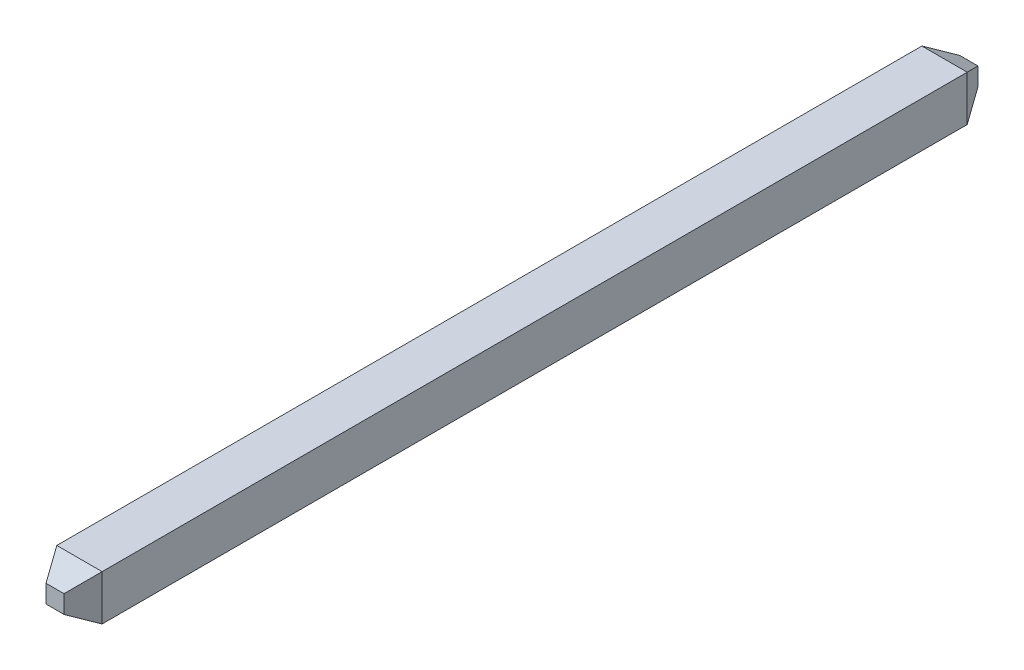
ISO-10303-21;
HEADER;
FILE_DESCRIPTION(('STEP AP214'),'2;1');
FILE_NAME('part.step','',(''),(''),'','','');
FILE_SCHEMA(('AUTOMOTIVE_DESIGN { 1 0 10303 214 1 1 1 1 }'));
ENDSEC;
DATA;
#1=APPLICATION_CONTEXT('core data for automotive mechanical design processes');
#2=APPLICATION_PROTOCOL_DEFINITION('international standard','automotive_design',2000,#1);
#3=PRODUCT_CONTEXT('',#1,'mechanical');
#4=PRODUCT('Part','Part','',(#3));
#5=PRODUCT_RELATED_PRODUCT_CATEGORY('part','',(#4));
#6=PRODUCT_DEFINITION_FORMATION('','',#4);
#7=PRODUCT_DEFINITION_CONTEXT('part definition',#1,'design');
#8=PRODUCT_DEFINITION('design','',#6,#7);
#9=PRODUCT_DEFINITION_SHAPE('','',#8);
#10=(LENGTH_UNIT() NAMED_UNIT(*) SI_UNIT(.MILLI.,.METRE.));
#11=(NAMED_UNIT(*) PLANE_ANGLE_UNIT() SI_UNIT($,.RADIAN.));
#12=(NAMED_UNIT(*) SI_UNIT($,.STERADIAN.) SOLID_ANGLE_UNIT());
#13=UNCERTAINTY_MEASURE_WITH_UNIT(LENGTH_MEASURE(1.E-05),#10,'distance_accuracy_value','');
#14=(GEOMETRIC_REPRESENTATION_CONTEXT(3) GLOBAL_UNCERTAINTY_ASSIGNED_CONTEXT((#13)) GLOBAL_UNIT_ASSIGNED_CONTEXT((#10,
#11,#12)) REPRESENTATION_CONTEXT('',''));
#15=CARTESIAN_POINT('',(0.,0.,0.));
#16=DIRECTION('',(0.,0.,1.));
#17=DIRECTION('',(1.,0.,0.));
#18=AXIS2_PLACEMENT_3D('',#15,#16,#17);
#19=CARTESIAN_POINT('',(10.2801151004192,-1.595,-3.20872569516347));
#20=DIRECTION('',(0.872569516347454,0.,-0.48848995807608));
#21=DIRECTION('',(-0.48848995807608,0.,-0.872569516347454));
#22=AXIS2_PLACEMENT_3D('',#19,#20,#21);
#23=PLANE('',#22);
#24=DIRECTION('',(0.,1.,0.));
#25=VECTOR('',#24,1.);
#26=CARTESIAN_POINT('',(10.4753418566447,-1.595,-2.86000017186176));
#27=LINE('',#26,#25);
#28=CARTESIAN_POINT('',(10.4753418566326,-1.58500002468493,-2.85999984563026));
#29=VERTEX_POINT('',#28);
#30=CARTESIAN_POINT('',(10.4753420172919,-0.954999839641339,-2.85999988490429));
#31=VERTEX_POINT('',#30);
#32=EDGE_CURVE('E118',#29,#31,#27,.T.);
#33=ORIENTED_EDGE('',*,*,#32,.F.);
#34=DIRECTION('',(0.439072617568685,-0.438284036988102,0.784297353956263));
#35=VECTOR('',#34,1.);
#36=CARTESIAN_POINT('',(10.285,-1.395,-3.2));
#37=LINE('',#36,#35);
#38=CARTESIAN_POINT('',(10.285,-1.395,-3.2));
#39=VERTEX_POINT('',#38);
#40=EDGE_CURVE('E116',#39,#29,#37,.T.);
#41=ORIENTED_EDGE('',*,*,#40,.F.);
#42=DIRECTION('',(0.,1.,0.));
#43=VECTOR('',#42,1.);
#44=CARTESIAN_POINT('',(10.285,-1.405,-3.2));
#45=LINE('',#44,#43);
#46=CARTESIAN_POINT('',(10.285,-1.145,-3.2));
#47=VERTEX_POINT('',#46);
#48=EDGE_CURVE('E79',#47,#39,#45,.F.);
#49=ORIENTED_EDGE('',*,*,#48,.F.);
#50=DIRECTION('',(-0.439072617568685,-0.438284036988102,-0.784297353956263));
#51=VECTOR('',#50,1.);
#52=CARTESIAN_POINT('',(10.4753418566447,-0.955000000000001,-2.86000017186176));
#53=LINE('',#52,#51);
#54=EDGE_CURVE('E110',#31,#47,#53,.T.);
#55=ORIENTED_EDGE('',*,*,#54,.F.);
#56=EDGE_LOOP('',(#33,#41,#49,#55));
#57=FACE_BOUND('',#56,.T.);
#58=ADVANCED_FACE('F17',(#57),#23,.T.);
#59=CARTESIAN_POINT('',(10.2803670281429,-1.595,9.50441734607014));
#60=DIRECTION('',(0.873317045523296,0.,0.487152273933378));
#61=DIRECTION('',(0.487152273933378,0.,-0.873317045523296));
#62=AXIS2_PLACEMENT_3D('',#59,#60,#61);
#63=PLANE('',#62);
#64=DIRECTION('',(-0.437799852400756,0.438586917260879,0.784839349959898));
#65=VECTOR('',#64,1.);
#66=CARTESIAN_POINT('',(10.4748978995516,-1.58500031317149,9.15568378706481));
#67=LINE('',#66,#65);
#68=CARTESIAN_POINT('',(10.4748976545499,-1.58500010892316,9.155683688451));
#69=VERTEX_POINT('',#68);
#70=CARTESIAN_POINT('',(10.2852385508823,-1.395,9.4956841756149));
#71=VERTEX_POINT('',#70);
#72=EDGE_CURVE('E122',#69,#71,#67,.T.);
#73=ORIENTED_EDGE('',*,*,#72,.F.);
#74=DIRECTION('',(0.,1.,0.));
#75=VECTOR('',#74,1.);
#76=CARTESIAN_POINT('',(10.4748985390065,-1.595,9.15568372243695));
#77=LINE('',#76,#75);
#78=CARTESIAN_POINT('',(10.4748976528046,-0.954999822967403,9.15568371270384));
#79=VERTEX_POINT('',#78);
#80=EDGE_CURVE('E89',#79,#69,#77,.F.);
#81=ORIENTED_EDGE('',*,*,#80,.F.);
#82=DIRECTION('',(0.437799852400942,0.438586917260834,-0.784839349959819));
#83=VECTOR('',#82,1.);
#84=CARTESIAN_POINT('',(10.2852385508823,-1.145,9.49568417561491));
#85=LINE('',#84,#83);
#86=CARTESIAN_POINT('',(10.2852385508823,-1.145,9.4956841756149));
#87=VERTEX_POINT('',#86);
#88=EDGE_CURVE('E84',#87,#79,#85,.T.);
#89=ORIENTED_EDGE('',*,*,#88,.F.);
#90=DIRECTION('',(0.,1.,0.));
#91=VECTOR('',#90,1.);
#92=CARTESIAN_POINT('',(10.2852385508823,-1.135,9.49568417561491));
#93=LINE('',#92,#91);
#94=EDGE_CURVE('E20',#71,#87,#93,.T.);
#95=ORIENTED_EDGE('',*,*,#94,.F.);
#96=EDGE_LOOP('',(#73,#81,#89,#95));
#97=FACE_BOUND('',#96,.T.);
#98=ADVANCED_FACE('F86',(#97),#63,.T.);
#99=CARTESIAN_POINT('',(10.0252385508823,-1.135,9.49568417561491));
#100=DIRECTION('',(0.,0.,1.));
#101=DIRECTION('',(1.,0.,0.));
#102=AXIS2_PLACEMENT_3D('',#99,#100,#101);
#103=PLANE('',#102);
#104=DIRECTION('',(1.,0.,0.));
#105=VECTOR('',#104,1.);
#106=CARTESIAN_POINT('',(9.8348966942376,-1.145,9.49568417561491));
#107=LINE('',#106,#105);
#108=CARTESIAN_POINT('',(10.0352385508823,-1.145,9.49568417561492));
#109=VERTEX_POINT('',#108);
#110=EDGE_CURVE('E93',#109,#87,#107,.T.);
#111=ORIENTED_EDGE('',*,*,#110,.F.);
#112=DIRECTION('',(0.,1.,0.));
#113=VECTOR('',#112,1.);
#114=CARTESIAN_POINT('',(10.0352385508823,-1.595,9.49568417561494));
#115=LINE('',#114,#113);
#116=CARTESIAN_POINT('',(10.0352385508823,-1.395,9.49568417561492));
#117=VERTEX_POINT('',#116);
#118=EDGE_CURVE('E129',#117,#109,#115,.T.);
#119=ORIENTED_EDGE('',*,*,#118,.F.);
#120=DIRECTION('',(1.,0.,0.));
#121=VECTOR('',#120,1.);
#122=CARTESIAN_POINT('',(9.8348966942376,-1.395,9.49568417561491));
#123=LINE('',#122,#121);
#124=EDGE_CURVE('E98',#71,#117,#123,.F.);
#125=ORIENTED_EDGE('',*,*,#124,.F.);
#126=ORIENTED_EDGE('',*,*,#94,.T.);
#127=EDGE_LOOP('',(#111,#119,#125,#126));
#128=FACE_BOUND('',#127,.T.);
#129=ADVANCED_FACE('F95',(#128),#103,.T.);
#130=CARTESIAN_POINT('',(9.8348966942376,-1.14987821545568,9.50441360938624));
#131=DIRECTION('',(0.,0.872943377132664,0.487821545567864));
#132=DIRECTION('',(0.,-0.487821545567864,0.872943377132664));
#133=AXIS2_PLACEMENT_3D('',#130,#131,#132);
#134=PLANE('',#133);
#135=DIRECTION('',(-0.439072459537936,0.438284700441645,-0.784297071672516));
#136=VECTOR('',#135,1.);
#137=CARTESIAN_POINT('',(10.0352385508823,-1.145,9.49568417561494));
#138=LINE('',#137,#136);
#139=CARTESIAN_POINT('',(9.84489750370277,-0.954999917527418,9.15568447138296));
#140=VERTEX_POINT('',#139);
#141=EDGE_CURVE('E102',#109,#140,#138,.T.);
#142=ORIENTED_EDGE('',*,*,#141,.F.);
#143=ORIENTED_EDGE('',*,*,#110,.T.);
#144=ORIENTED_EDGE('',*,*,#88,.T.);
#145=DIRECTION('',(1.,0.,0.));
#146=VECTOR('',#145,1.);
#147=CARTESIAN_POINT('',(10.1600665893728,-0.955,9.15568497320465));
#148=LINE('',#147,#146);
#149=EDGE_CURVE('E131',#140,#79,#148,.T.);
#150=ORIENTED_EDGE('',*,*,#149,.F.);
#151=EDGE_LOOP('',(#142,#143,#144,#150));
#152=FACE_BOUND('',#151,.T.);
#153=ADVANCED_FACE('F100',(#152),#134,.T.);
#154=CARTESIAN_POINT('',(10.025,-1.405,-3.2));
#155=DIRECTION('',(0.,0.,-1.));
#156=DIRECTION('',(-1.,0.,0.));
#157=AXIS2_PLACEMENT_3D('',#154,#155,#156);
#158=PLANE('',#157);
#159=ORIENTED_EDGE('',*,*,#48,.T.);
#160=DIRECTION('',(1.,0.,0.));
#161=VECTOR('',#160,1.);
#162=CARTESIAN_POINT('',(9.83534185664468,-1.395,-3.2));
#163=LINE('',#162,#161);
#164=CARTESIAN_POINT('',(10.035,-1.395,-3.2));
#165=VERTEX_POINT('',#164);
#166=EDGE_CURVE('E113',#165,#39,#163,.T.);
#167=ORIENTED_EDGE('',*,*,#166,.F.);
#168=DIRECTION('',(0.,1.,0.));
#169=VECTOR('',#168,1.);
#170=CARTESIAN_POINT('',(10.035,-1.595,-3.20000000000001));
#171=LINE('',#170,#169);
#172=CARTESIAN_POINT('',(10.035,-1.145,-3.2));
#173=VERTEX_POINT('',#172);
#174=EDGE_CURVE('E140',#173,#165,#171,.F.);
#175=ORIENTED_EDGE('',*,*,#174,.F.);
#176=DIRECTION('',(1.,0.,0.));
#177=VECTOR('',#176,1.);
#178=CARTESIAN_POINT('',(9.83534185664468,-1.145,-3.2));
#179=LINE('',#178,#177);
#180=EDGE_CURVE('E105',#47,#173,#179,.F.);
#181=ORIENTED_EDGE('',*,*,#180,.F.);
#182=EDGE_LOOP('',(#159,#167,#175,#181));
#183=FACE_BOUND('',#182,.T.);
#184=ADVANCED_FACE('F184',(#183),#158,.T.);
#185=CARTESIAN_POINT('',(9.83534185664468,-0.950121784544321,-2.85127073809043));
#186=DIRECTION('',(0.,0.872943377132663,-0.487821545567865));
#187=DIRECTION('',(0.,0.487821545567865,0.872943377132663));
#188=AXIS2_PLACEMENT_3D('',#185,#186,#187);
#189=PLANE('',#188);
#190=DIRECTION('',(1.,0.,0.));
#191=VECTOR('',#190,1.);
#192=CARTESIAN_POINT('',(10.1600665893728,-0.955,-2.86000017186176));
#193=LINE('',#192,#191);
#194=CARTESIAN_POINT('',(9.84534144768618,-0.954999293190896,-2.8599984305592));
#195=VERTEX_POINT('',#194);
#196=EDGE_CURVE('E137',#31,#195,#193,.F.);
#197=ORIENTED_EDGE('',*,*,#196,.F.);
#198=ORIENTED_EDGE('',*,*,#54,.T.);
#199=ORIENTED_EDGE('',*,*,#180,.T.);
#200=DIRECTION('',(0.437798396819591,-0.438586429089659,-0.784840434713055));
#201=VECTOR('',#200,1.);
#202=CARTESIAN_POINT('',(9.84534066407529,-0.954999279369218,-2.85999803394472));
#203=LINE('',#202,#201);
#204=EDGE_CURVE('E145',#195,#173,#203,.T.);
#205=ORIENTED_EDGE('',*,*,#204,.F.);
#206=EDGE_LOOP('',(#197,#198,#199,#205));
#207=FACE_BOUND('',#206,.T.);
#208=ADVANCED_FACE('F182',(#207),#189,.T.);
#209=CARTESIAN_POINT('',(9.83534185664468,-1.39012178454432,-3.20872943377133));
#210=DIRECTION('',(0.,-0.872943377132663,-0.487821545567865));
#211=DIRECTION('',(0.,0.487821545567865,-0.872943377132663));
#212=AXIS2_PLACEMENT_3D('',#209,#210,#211);
#213=PLANE('',#212);
#214=ORIENTED_EDGE('',*,*,#166,.T.);
#215=ORIENTED_EDGE('',*,*,#40,.T.);
#216=DIRECTION('',(1.,0.,0.));
#217=VECTOR('',#216,1.);
#218=CARTESIAN_POINT('',(9.83494834685547,-1.585,-2.85999756200983));
#219=LINE('',#218,#217);
#220=CARTESIAN_POINT('',(9.84534198218487,-1.58500027023654,-2.85999898491792));
#221=VERTEX_POINT('',#220);
#222=EDGE_CURVE('E35',#221,#29,#219,.T.);
#223=ORIENTED_EDGE('',*,*,#222,.F.);
#224=DIRECTION('',(-0.437798396819591,-0.438586429089663,0.784840434713053));
#225=VECTOR('',#224,1.);
#226=CARTESIAN_POINT('',(10.035,-1.395,-3.20000000000001));
#227=LINE('',#226,#225);
#228=EDGE_CURVE('E143',#165,#221,#227,.T.);
#229=ORIENTED_EDGE('',*,*,#228,.F.);
#230=EDGE_LOOP('',(#214,#215,#223,#229));
#231=FACE_BOUND('',#230,.T.);
#232=ADVANCED_FACE('F185',(#231),#213,.T.);
#233=CARTESIAN_POINT('',(10.4753463082688,-1.595,-2.98065701705514));
#234=DIRECTION('',(0.999999999319383,0.,3.68949151672057E-05));
#235=DIRECTION('',(3.68949151672057E-05,0.,-0.999999999319383));
#236=AXIS2_PLACEMENT_3D('',#233,#234,#235);
#237=PLANE('',#236);
#238=DIRECTION('',(3.69481335064168E-05,0.,-0.999999999317418));
#239=VECTOR('',#238,1.);
#240=CARTESIAN_POINT('',(10.4748978995517,-0.955,9.15568372241336));
#241=LINE('',#240,#239);
#242=EDGE_CURVE('E134',#79,#31,#241,.T.);
#243=ORIENTED_EDGE('',*,*,#242,.F.);
#244=ORIENTED_EDGE('',*,*,#80,.T.);
#245=DIRECTION('',(-3.69481335147904E-05,0.,0.999999999317418));
#246=VECTOR('',#245,1.);
#247=CARTESIAN_POINT('',(10.4753418566447,-1.585,-2.86000017186176));
#248=LINE('',#247,#246);
#249=EDGE_CURVE('E149',#29,#69,#248,.T.);
#250=ORIENTED_EDGE('',*,*,#249,.F.);
#251=ORIENTED_EDGE('',*,*,#32,.T.);
#252=EDGE_LOOP('',(#243,#244,#250,#251));
#253=FACE_BOUND('',#252,.T.);
#254=ADVANCED_FACE('F187',(#253),#237,.T.);
#255=CARTESIAN_POINT('',(9.8348966942376,-1.58987821545568,9.14695491370534));
#256=DIRECTION('',(0.,-0.872943377132664,0.487821545567864));
#257=DIRECTION('',(0.,-0.487821545567864,-0.872943377132664));
#258=AXIS2_PLACEMENT_3D('',#255,#256,#257);
#259=PLANE('',#258);
#260=ORIENTED_EDGE('',*,*,#124,.T.);
#261=DIRECTION('',(0.439072459537937,0.438284700441644,0.784297071672517));
#262=VECTOR('',#261,1.);
#263=CARTESIAN_POINT('',(9.84489724886551,-1.5849998023649,9.15568533818577));
#264=LINE('',#263,#262);
#265=CARTESIAN_POINT('',(9.84489781760236,-1.58499988392429,9.15568487573229));
#266=VERTEX_POINT('',#265);
#267=EDGE_CURVE('E126',#266,#117,#264,.T.);
#268=ORIENTED_EDGE('',*,*,#267,.F.);
#269=DIRECTION('',(1.,0.,0.));
#270=VECTOR('',#269,1.);
#271=CARTESIAN_POINT('',(9.83494834685547,-1.585,9.15568372241336));
#272=LINE('',#271,#270);
#273=EDGE_CURVE('E152',#69,#266,#272,.F.);
#274=ORIENTED_EDGE('',*,*,#273,.F.);
#275=ORIENTED_EDGE('',*,*,#72,.T.);
#276=EDGE_LOOP('',(#260,#268,#274,#275));
#277=FACE_BOUND('',#276,.T.);
#278=ADVANCED_FACE('F174',(#277),#259,.T.);
#279=CARTESIAN_POINT('',(10.040123450463,-1.595,9.50440987077839));
#280=DIRECTION('',(-0.872569516347452,0.,0.488489958076083));
#281=DIRECTION('',(0.488489958076083,0.,0.872569516347452));
#282=AXIS2_PLACEMENT_3D('',#279,#280,#281);
#283=PLANE('',#282);
#284=ORIENTED_EDGE('',*,*,#267,.T.);
#285=ORIENTED_EDGE('',*,*,#118,.T.);
#286=ORIENTED_EDGE('',*,*,#141,.T.);
#287=DIRECTION('',(0.,1.,0.));
#288=VECTOR('',#287,1.);
#289=CARTESIAN_POINT('',(9.84489853896027,-1.595,9.15568497322819));
#290=LINE('',#289,#288);
#291=EDGE_CURVE('E155',#266,#140,#290,.T.);
#292=ORIENTED_EDGE('',*,*,#291,.F.);
#293=EDGE_LOOP('',(#284,#285,#286,#292));
#294=FACE_BOUND('',#293,.T.);
#295=ADVANCED_FACE('F177',(#294),#283,.T.);
#296=CARTESIAN_POINT('',(10.1600665893728,-0.955,9.32634470275115));
#297=DIRECTION('',(0.,1.,0.));
#298=DIRECTION('',(0.,0.,1.));
#299=AXIS2_PLACEMENT_3D('',#296,#297,#298);
#300=PLANE('',#299);
#301=ORIENTED_EDGE('',*,*,#196,.T.);
#302=DIRECTION('',(-3.68949151673762E-05,0.,0.999999999319383));
#303=VECTOR('',#302,1.);
#304=CARTESIAN_POINT('',(9.84489224235438,-0.955000197635099,9.32634821671993));
#305=LINE('',#304,#303);
#306=EDGE_CURVE('E158',#140,#195,#305,.F.);
#307=ORIENTED_EDGE('',*,*,#306,.F.);
#308=ORIENTED_EDGE('',*,*,#149,.T.);
#309=ORIENTED_EDGE('',*,*,#242,.T.);
#310=EDGE_LOOP('',(#301,#307,#308,#309));
#311=FACE_BOUND('',#310,.T.);
#312=ADVANCED_FACE('F179',(#311),#300,.T.);
#313=CARTESIAN_POINT('',(10.0398715227393,-1.595,-3.20873317045523));
#314=DIRECTION('',(-0.873317045523299,0.,-0.487152273933373));
#315=DIRECTION('',(-0.487152273933373,0.,0.873317045523299));
#316=AXIS2_PLACEMENT_3D('',#313,#314,#315);
#317=PLANE('',#316);
#318=DIRECTION('',(0.,1.,0.));
#319=VECTOR('',#318,1.);
#320=CARTESIAN_POINT('',(9.84534185654839,-1.595,-2.85999756199704));
#321=LINE('',#320,#319);
#322=EDGE_CURVE('E26',#195,#221,#321,.F.);
#323=ORIENTED_EDGE('',*,*,#322,.F.);
#324=ORIENTED_EDGE('',*,*,#204,.T.);
#325=ORIENTED_EDGE('',*,*,#174,.T.);
#326=ORIENTED_EDGE('',*,*,#228,.T.);
#327=EDGE_LOOP('',(#323,#324,#325,#326));
#328=FACE_BOUND('',#327,.T.);
#329=ADVANCED_FACE('F168',(#328),#317,.T.);
#330=CARTESIAN_POINT('',(9.83494834685547,-1.585,3.17284922525592));
#331=DIRECTION('',(0.,-1.,0.));
#332=DIRECTION('',(0.,0.,-1.));
#333=AXIS2_PLACEMENT_3D('',#330,#331,#332);
#334=PLANE('',#333);
#335=ORIENTED_EDGE('',*,*,#249,.T.);
#336=ORIENTED_EDGE('',*,*,#273,.T.);
#337=DIRECTION('',(-3.68949151673762E-05,0.,0.999999999319383));
#338=VECTOR('',#337,1.);
#339=CARTESIAN_POINT('',(9.84489224235438,-1.58500072063078,9.32634821671993));
#340=LINE('',#339,#338);
#341=EDGE_CURVE('E11',#221,#266,#340,.T.);
#342=ORIENTED_EDGE('',*,*,#341,.F.);
#343=ORIENTED_EDGE('',*,*,#222,.T.);
#344=EDGE_LOOP('',(#335,#336,#342,#343));
#345=FACE_BOUND('',#344,.T.);
#346=ADVANCED_FACE('F170',(#345),#334,.T.);
#347=CARTESIAN_POINT('',(9.84489224235438,-1.595,9.32634821671993));
#348=DIRECTION('',(-0.999999999319383,0.,-3.68949151673762E-05));
#349=DIRECTION('',(-3.68949151673762E-05,0.,0.999999999319383));
#350=AXIS2_PLACEMENT_3D('',#347,#348,#349);
#351=PLANE('',#350);
#352=ORIENTED_EDGE('',*,*,#322,.T.);
#353=ORIENTED_EDGE('',*,*,#341,.T.);
#354=ORIENTED_EDGE('',*,*,#291,.T.);
#355=ORIENTED_EDGE('',*,*,#306,.T.);
#356=EDGE_LOOP('',(#352,#353,#354,#355));
#357=FACE_BOUND('',#356,.T.);
#358=ADVANCED_FACE('F164',(#357),#351,.T.);
#359=CLOSED_SHELL('',(#58,#98,#129,#153,#184,#208,#232,#254,#278,#295,#312,#329,#346,#358));
#360=MANIFOLD_SOLID_BREP('B1',#359);
#361=ADVANCED_BREP_SHAPE_REPRESENTATION('',(#18,#360),#14);
#362=SHAPE_DEFINITION_REPRESENTATION(#9,#361);
ENDSEC;
END-ISO-10303-21;
